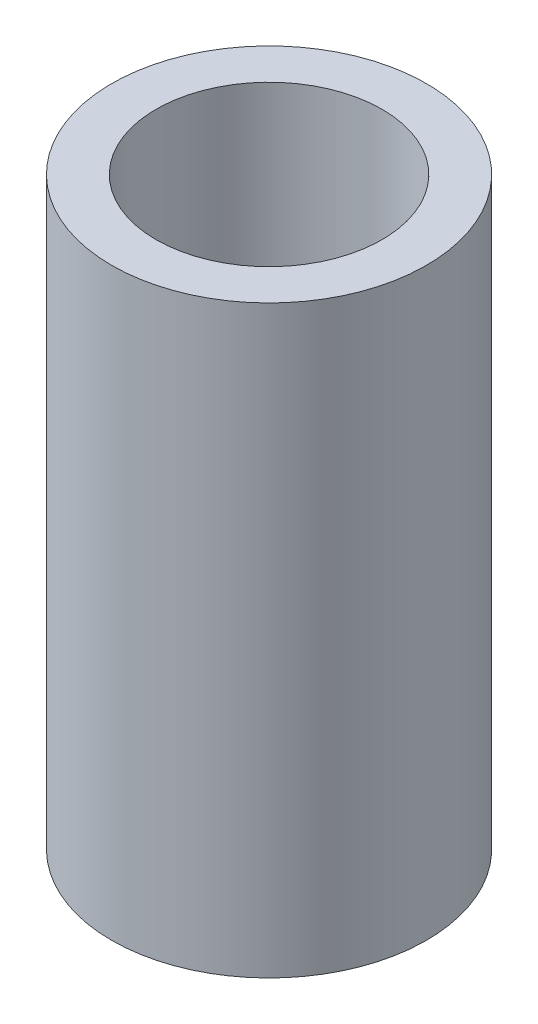
ISO-10303-21;
HEADER;
FILE_DESCRIPTION(('STEP AP214'),'2;1');
FILE_NAME('part.step','',(''),(''),'','','');
FILE_SCHEMA(('AUTOMOTIVE_DESIGN { 1 0 10303 214 1 1 1 1 }'));
ENDSEC;
DATA;
#1=APPLICATION_CONTEXT('core data for automotive mechanical design processes');
#2=APPLICATION_PROTOCOL_DEFINITION('international standard','automotive_design',2000,#1);
#3=PRODUCT_CONTEXT('',#1,'mechanical');
#4=PRODUCT('Part','Part','',(#3));
#5=PRODUCT_RELATED_PRODUCT_CATEGORY('part','',(#4));
#6=PRODUCT_DEFINITION_FORMATION('','',#4);
#7=PRODUCT_DEFINITION_CONTEXT('part definition',#1,'design');
#8=PRODUCT_DEFINITION('design','',#6,#7);
#9=PRODUCT_DEFINITION_SHAPE('','',#8);
#10=(LENGTH_UNIT() NAMED_UNIT(*) SI_UNIT(.MILLI.,.METRE.));
#11=(NAMED_UNIT(*) PLANE_ANGLE_UNIT() SI_UNIT($,.RADIAN.));
#12=(NAMED_UNIT(*) SI_UNIT($,.STERADIAN.) SOLID_ANGLE_UNIT());
#13=UNCERTAINTY_MEASURE_WITH_UNIT(LENGTH_MEASURE(1.E-05),#10,'distance_accuracy_value','');
#14=(GEOMETRIC_REPRESENTATION_CONTEXT(3) GLOBAL_UNCERTAINTY_ASSIGNED_CONTEXT((#13)) GLOBAL_UNIT_ASSIGNED_CONTEXT((#10,
#11,#12)) REPRESENTATION_CONTEXT('',''));
#15=CARTESIAN_POINT('',(0.,0.,0.));
#16=DIRECTION('',(0.,0.,1.));
#17=DIRECTION('',(1.,0.,0.));
#18=AXIS2_PLACEMENT_3D('',#15,#16,#17);
#19=CARTESIAN_POINT('',(0.,92.8431617460275,0.));
#20=DIRECTION('',(0.,-1.,0.));
#21=DIRECTION('',(0.,0.,-1.));
#22=AXIS2_PLACEMENT_3D('',#19,#20,#21);
#23=CYLINDRICAL_SURFACE('',#22,25.);
#24=CARTESIAN_POINT('',(0.,92.8431617460275,0.));
#25=DIRECTION('',(0.,1.,0.));
#26=DIRECTION('',(0.,0.,1.));
#27=AXIS2_PLACEMENT_3D('',#24,#25,#26);
#28=CIRCLE('',#27,25.);
#29=CARTESIAN_POINT('',(0.,92.8431617460275,25.));
#30=VERTEX_POINT('',#29);
#31=EDGE_CURVE('E10',#30,#30,#28,.T.);
#32=ORIENTED_EDGE('',*,*,#31,.F.);
#33=EDGE_LOOP('',(#32));
#34=FACE_BOUND('',#33,.T.);
#35=CARTESIAN_POINT('',(0.,0.,0.));
#36=DIRECTION('',(0.,1.,0.));
#37=DIRECTION('',(0.,0.,1.));
#38=AXIS2_PLACEMENT_3D('',#35,#36,#37);
#39=CIRCLE('',#38,25.);
#40=CARTESIAN_POINT('',(0.,0.,25.));
#41=VERTEX_POINT('',#40);
#42=EDGE_CURVE('E37',#41,#41,#39,.T.);
#43=ORIENTED_EDGE('',*,*,#42,.T.);
#44=EDGE_LOOP('',(#43));
#45=FACE_BOUND('',#44,.T.);
#46=ADVANCED_FACE('F40',(#34,#45),#23,.T.);
#47=CARTESIAN_POINT('',(0.,92.8431617460275,0.));
#48=DIRECTION('',(0.,1.,0.));
#49=DIRECTION('',(0.,0.,1.));
#50=AXIS2_PLACEMENT_3D('',#47,#48,#49);
#51=PLANE('',#50);
#52=CARTESIAN_POINT('',(0.,92.8431617460275,0.));
#53=DIRECTION('',(0.,1.,0.));
#54=DIRECTION('',(0.,0.,1.));
#55=AXIS2_PLACEMENT_3D('',#52,#53,#54);
#56=CIRCLE('',#55,17.9449445062996);
#57=CARTESIAN_POINT('',(0.,92.8431617460275,17.9449445062996));
#58=VERTEX_POINT('',#57);
#59=EDGE_CURVE('E50',#58,#58,#56,.T.);
#60=ORIENTED_EDGE('',*,*,#59,.F.);
#61=EDGE_LOOP('',(#60));
#62=FACE_BOUND('',#61,.T.);
#63=ORIENTED_EDGE('',*,*,#31,.T.);
#64=EDGE_LOOP('',(#63));
#65=FACE_BOUND('',#64,.T.);
#66=ADVANCED_FACE('F59',(#62,#65),#51,.T.);
#67=CARTESIAN_POINT('',(0.,0.,0.));
#68=DIRECTION('',(0.,1.,0.));
#69=DIRECTION('',(0.,0.,1.));
#70=AXIS2_PLACEMENT_3D('',#67,#68,#69);
#71=PLANE('',#70);
#72=CARTESIAN_POINT('',(0.,0.,0.));
#73=DIRECTION('',(0.,1.,0.));
#74=DIRECTION('',(0.,0.,1.));
#75=AXIS2_PLACEMENT_3D('',#72,#73,#74);
#76=CIRCLE('',#75,17.9449445062996);
#77=CARTESIAN_POINT('',(0.,0.,17.9449445062996));
#78=VERTEX_POINT('',#77);
#79=EDGE_CURVE('E47',#78,#78,#76,.T.);
#80=ORIENTED_EDGE('',*,*,#79,.T.);
#81=EDGE_LOOP('',(#80));
#82=FACE_BOUND('',#81,.T.);
#83=ORIENTED_EDGE('',*,*,#42,.F.);
#84=EDGE_LOOP('',(#83));
#85=FACE_BOUND('',#84,.T.);
#86=ADVANCED_FACE('F58',(#82,#85),#71,.F.);
#87=CARTESIAN_POINT('',(0.,92.8431617460275,0.));
#88=DIRECTION('',(0.,-1.,0.));
#89=DIRECTION('',(0.,0.,-1.));
#90=AXIS2_PLACEMENT_3D('',#87,#88,#89);
#91=CYLINDRICAL_SURFACE('',#90,17.9449445062996);
#92=ORIENTED_EDGE('',*,*,#59,.T.);
#93=EDGE_LOOP('',(#92));
#94=FACE_BOUND('',#93,.T.);
#95=ORIENTED_EDGE('',*,*,#79,.F.);
#96=EDGE_LOOP('',(#95));
#97=FACE_BOUND('',#96,.T.);
#98=ADVANCED_FACE('F54',(#94,#97),#91,.F.);
#99=CLOSED_SHELL('',(#46,#66,#86,#98));
#100=MANIFOLD_SOLID_BREP('B2',#99);
#101=ADVANCED_BREP_SHAPE_REPRESENTATION('',(#18,#100),#14);
#102=SHAPE_DEFINITION_REPRESENTATION(#9,#101);
ENDSEC;
END-ISO-10303-21;
